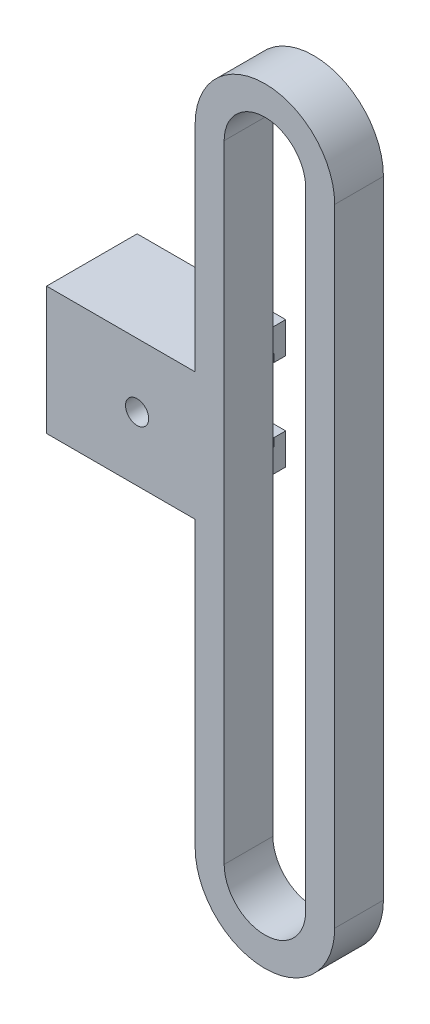
ISO-10303-21;
HEADER;
FILE_DESCRIPTION(('STEP AP214'),'2;1');
FILE_NAME('part.step','',(''),(''),'','','');
FILE_SCHEMA(('AUTOMOTIVE_DESIGN { 1 0 10303 214 1 1 1 1 }'));
ENDSEC;
DATA;
#1=APPLICATION_CONTEXT('core data for automotive mechanical design processes');
#2=APPLICATION_PROTOCOL_DEFINITION('international standard','automotive_design',2000,#1);
#3=PRODUCT_CONTEXT('',#1,'mechanical');
#4=PRODUCT('Part','Part','',(#3));
#5=PRODUCT_RELATED_PRODUCT_CATEGORY('part','',(#4));
#6=PRODUCT_DEFINITION_FORMATION('','',#4);
#7=PRODUCT_DEFINITION_CONTEXT('part definition',#1,'design');
#8=PRODUCT_DEFINITION('design','',#6,#7);
#9=PRODUCT_DEFINITION_SHAPE('','',#8);
#10=(LENGTH_UNIT() NAMED_UNIT(*) SI_UNIT(.MILLI.,.METRE.));
#11=(NAMED_UNIT(*) PLANE_ANGLE_UNIT() SI_UNIT($,.RADIAN.));
#12=(NAMED_UNIT(*) SI_UNIT($,.STERADIAN.) SOLID_ANGLE_UNIT());
#13=UNCERTAINTY_MEASURE_WITH_UNIT(LENGTH_MEASURE(1.E-05),#10,'distance_accuracy_value','');
#14=(GEOMETRIC_REPRESENTATION_CONTEXT(3) GLOBAL_UNCERTAINTY_ASSIGNED_CONTEXT((#13)) GLOBAL_UNIT_ASSIGNED_CONTEXT((#10,
#11,#12)) REPRESENTATION_CONTEXT('',''));
#15=CARTESIAN_POINT('',(0.,0.,0.));
#16=DIRECTION('',(0.,0.,1.));
#17=DIRECTION('',(1.,0.,0.));
#18=AXIS2_PLACEMENT_3D('',#15,#16,#17);
#19=CARTESIAN_POINT('',(-6.01,10.3450930626058,4.2));
#20=DIRECTION('',(1.,0.,0.));
#21=DIRECTION('',(0.,1.,0.));
#22=AXIS2_PLACEMENT_3D('',#19,#20,#21);
#23=PLANE('',#22);
#24=DIRECTION('',(0.,0.,-1.));
#25=VECTOR('',#24,1.);
#26=CARTESIAN_POINT('',(-6.01,-8.15490693739424,4.2));
#27=LINE('',#26,#25);
#28=CARTESIAN_POINT('',(-6.01,-8.15490693739424,4.2));
#29=VERTEX_POINT('',#28);
#30=CARTESIAN_POINT('',(-6.01,-8.15490693739424,0.));
#31=VERTEX_POINT('',#30);
#32=EDGE_CURVE('E263',#29,#31,#27,.T.);
#33=ORIENTED_EDGE('',*,*,#32,.F.);
#34=DIRECTION('',(0.,-1.,0.));
#35=VECTOR('',#34,1.);
#36=CARTESIAN_POINT('',(-6.01,10.3450930626058,4.2));
#37=LINE('',#36,#35);
#38=CARTESIAN_POINT('',(-6.01,10.3450930626058,4.2));
#39=VERTEX_POINT('',#38);
#40=EDGE_CURVE('E325',#39,#29,#37,.T.);
#41=ORIENTED_EDGE('',*,*,#40,.F.);
#42=DIRECTION('',(0.,0.,-1.));
#43=VECTOR('',#42,1.);
#44=CARTESIAN_POINT('',(-6.01,10.3450930626058,4.2));
#45=LINE('',#44,#43);
#46=CARTESIAN_POINT('',(-6.01,10.3450930626058,0.));
#47=VERTEX_POINT('',#46);
#48=EDGE_CURVE('E351',#39,#47,#45,.T.);
#49=ORIENTED_EDGE('',*,*,#48,.T.);
#50=DIRECTION('',(0.,-1.,0.));
#51=VECTOR('',#50,1.);
#52=CARTESIAN_POINT('',(-6.01,10.3450930626058,0.));
#53=LINE('',#52,#51);
#54=EDGE_CURVE('E336',#47,#31,#53,.T.);
#55=ORIENTED_EDGE('',*,*,#54,.T.);
#56=EDGE_LOOP('',(#33,#41,#49,#55));
#57=FACE_BOUND('',#56,.T.);
#58=ADVANCED_FACE('F32',(#57),#23,.F.);
#59=DIRECTION('',(0.,0.,1.));
#60=VECTOR('',#59,1.);
#61=CARTESIAN_POINT('',(-6.01,-10.1549069373942,4.2));
#62=LINE('',#61,#60);
#63=CARTESIAN_POINT('',(-6.01,-10.1549069373942,0.));
#64=VERTEX_POINT('',#63);
#65=CARTESIAN_POINT('',(-6.01,-10.1549069373942,2.2));
#66=VERTEX_POINT('',#65);
#67=EDGE_CURVE('E11',#64,#66,#62,.T.);
#68=ORIENTED_EDGE('',*,*,#67,.F.);
#69=CARTESIAN_POINT('',(-6.01,-17.1549069373942,0.));
#70=VERTEX_POINT('',#69);
#71=EDGE_CURVE('E458',#64,#70,#53,.T.);
#72=ORIENTED_EDGE('',*,*,#71,.T.);
#73=DIRECTION('',(0.,0.,-1.));
#74=VECTOR('',#73,1.);
#75=CARTESIAN_POINT('',(-6.01,-17.1549069373942,2.2));
#76=LINE('',#75,#74);
#77=CARTESIAN_POINT('',(-6.01,-17.1549069373942,2.2));
#78=VERTEX_POINT('',#77);
#79=EDGE_CURVE('E51',#78,#70,#76,.T.);
#80=ORIENTED_EDGE('',*,*,#79,.F.);
#81=DIRECTION('',(0.,-1.,0.));
#82=VECTOR('',#81,1.);
#83=CARTESIAN_POINT('',(-6.01,-10.1549069373942,2.2));
#84=LINE('',#83,#82);
#85=EDGE_CURVE('E47',#66,#78,#84,.T.);
#86=ORIENTED_EDGE('',*,*,#85,.F.);
#87=EDGE_LOOP('',(#68,#72,#80,#86));
#88=FACE_BOUND('',#87,.T.);
#89=ADVANCED_FACE('F410',(#88),#23,.F.);
#90=DIRECTION('',(0.,0.,1.));
#91=VECTOR('',#90,1.);
#92=CARTESIAN_POINT('',(-6.01,-19.1549069373942,4.2));
#93=LINE('',#92,#91);
#94=CARTESIAN_POINT('',(-6.01,-19.1549069373942,0.));
#95=VERTEX_POINT('',#94);
#96=CARTESIAN_POINT('',(-6.01,-19.1549069373942,4.2));
#97=VERTEX_POINT('',#96);
#98=EDGE_CURVE('E40',#95,#97,#93,.T.);
#99=ORIENTED_EDGE('',*,*,#98,.F.);
#100=CARTESIAN_POINT('',(-6.01,-43.6549069373942,0.));
#101=VERTEX_POINT('',#100);
#102=EDGE_CURVE('E335',#95,#101,#53,.T.);
#103=ORIENTED_EDGE('',*,*,#102,.T.);
#104=DIRECTION('',(0.,0.,-1.));
#105=VECTOR('',#104,1.);
#106=CARTESIAN_POINT('',(-6.01,-43.6549069373942,4.2));
#107=LINE('',#106,#105);
#108=CARTESIAN_POINT('',(-6.01,-43.6549069373942,4.2));
#109=VERTEX_POINT('',#108);
#110=EDGE_CURVE('E348',#109,#101,#107,.T.);
#111=ORIENTED_EDGE('',*,*,#110,.F.);
#112=EDGE_CURVE('E323',#97,#109,#37,.T.);
#113=ORIENTED_EDGE('',*,*,#112,.F.);
#114=EDGE_LOOP('',(#99,#103,#111,#113));
#115=FACE_BOUND('',#114,.T.);
#116=ADVANCED_FACE('F412',(#115),#23,.F.);
#117=CARTESIAN_POINT('',(0.,10.3450930626058,4.2));
#118=DIRECTION('',(0.,0.,1.));
#119=DIRECTION('',(1.,0.,0.));
#120=AXIS2_PLACEMENT_3D('',#117,#118,#119);
#121=PLANE('',#120);
#122=CARTESIAN_POINT('',(-11.01,-13.6549069373942,4.2));
#123=DIRECTION('',(0.,0.,1.));
#124=DIRECTION('',(1.,0.,0.));
#125=AXIS2_PLACEMENT_3D('',#122,#123,#124);
#126=CIRCLE('',#125,1.);
#127=CARTESIAN_POINT('',(-10.01,-13.6549069373942,4.2));
#128=VERTEX_POINT('',#127);
#129=EDGE_CURVE('E248',#128,#128,#126,.T.);
#130=ORIENTED_EDGE('',*,*,#129,.F.);
#131=EDGE_LOOP('',(#130));
#132=FACE_BOUND('',#131,.T.);
#133=CARTESIAN_POINT('',(0.,10.3450930626058,4.2));
#134=DIRECTION('',(0.,0.,1.));
#135=DIRECTION('',(1.,0.,0.));
#136=AXIS2_PLACEMENT_3D('',#133,#134,#135);
#137=CIRCLE('',#136,6.01);
#138=CARTESIAN_POINT('',(6.01,10.3450930626058,4.2));
#139=VERTEX_POINT('',#138);
#140=EDGE_CURVE('E320',#139,#39,#137,.T.);
#141=ORIENTED_EDGE('',*,*,#140,.T.);
#142=ORIENTED_EDGE('',*,*,#40,.T.);
#143=DIRECTION('',(1.,0.,0.));
#144=VECTOR('',#143,1.);
#145=CARTESIAN_POINT('',(-18.81,-8.15490693739424,4.2));
#146=LINE('',#145,#144);
#147=CARTESIAN_POINT('',(-18.81,-8.15490693739424,4.2));
#148=VERTEX_POINT('',#147);
#149=EDGE_CURVE('E285',#148,#29,#146,.T.);
#150=ORIENTED_EDGE('',*,*,#149,.F.);
#151=DIRECTION('',(0.,1.,0.));
#152=VECTOR('',#151,1.);
#153=CARTESIAN_POINT('',(-18.81,-19.1549069373942,4.2));
#154=LINE('',#153,#152);
#155=CARTESIAN_POINT('',(-18.81,-19.1549069373942,4.2));
#156=VERTEX_POINT('',#155);
#157=EDGE_CURVE('E252',#156,#148,#154,.T.);
#158=ORIENTED_EDGE('',*,*,#157,.F.);
#159=DIRECTION('',(1.,0.,0.));
#160=VECTOR('',#159,1.);
#161=CARTESIAN_POINT('',(-18.81,-19.1549069373942,4.2));
#162=LINE('',#161,#160);
#163=EDGE_CURVE('E187',#156,#97,#162,.T.);
#164=ORIENTED_EDGE('',*,*,#163,.T.);
#165=ORIENTED_EDGE('',*,*,#112,.T.);
#166=CARTESIAN_POINT('',(0.,-43.6549069373942,4.2));
#167=DIRECTION('',(0.,0.,1.));
#168=DIRECTION('',(1.,0.,0.));
#169=AXIS2_PLACEMENT_3D('',#166,#167,#168);
#170=CIRCLE('',#169,6.01);
#171=CARTESIAN_POINT('',(6.01000000000001,-43.6549069373942,4.2));
#172=VERTEX_POINT('',#171);
#173=EDGE_CURVE('E328',#109,#172,#170,.T.);
#174=ORIENTED_EDGE('',*,*,#173,.T.);
#175=DIRECTION('',(0.,1.,0.));
#176=VECTOR('',#175,1.);
#177=CARTESIAN_POINT('',(6.01,10.3450930626058,4.2));
#178=LINE('',#177,#176);
#179=EDGE_CURVE('E330',#172,#139,#178,.T.);
#180=ORIENTED_EDGE('',*,*,#179,.T.);
#181=EDGE_LOOP('',(#141,#142,#150,#158,#164,#165,#174,#180));
#182=FACE_BOUND('',#181,.T.);
#183=DIRECTION('',(0.,-1.,0.));
#184=VECTOR('',#183,1.);
#185=CARTESIAN_POINT('',(-3.51,10.3450930626058,4.2));
#186=LINE('',#185,#184);
#187=CARTESIAN_POINT('',(-3.51,10.3450930626058,4.2));
#188=VERTEX_POINT('',#187);
#189=CARTESIAN_POINT('',(-3.51,-43.6549069373942,4.2));
#190=VERTEX_POINT('',#189);
#191=EDGE_CURVE('E291',#188,#190,#186,.T.);
#192=ORIENTED_EDGE('',*,*,#191,.F.);
#193=CARTESIAN_POINT('',(0.,10.3450930626058,4.2));
#194=DIRECTION('',(0.,0.,1.));
#195=DIRECTION('',(1.,0.,0.));
#196=AXIS2_PLACEMENT_3D('',#193,#194,#195);
#197=CIRCLE('',#196,3.51);
#198=CARTESIAN_POINT('',(3.51,10.3450930626058,4.2));
#199=VERTEX_POINT('',#198);
#200=EDGE_CURVE('E289',#199,#188,#197,.T.);
#201=ORIENTED_EDGE('',*,*,#200,.F.);
#202=DIRECTION('',(0.,1.,0.));
#203=VECTOR('',#202,1.);
#204=CARTESIAN_POINT('',(3.51,10.3450930626058,4.2));
#205=LINE('',#204,#203);
#206=CARTESIAN_POINT('',(3.51000000000001,-43.6549069373942,4.2));
#207=VERTEX_POINT('',#206);
#208=EDGE_CURVE('E297',#207,#199,#205,.T.);
#209=ORIENTED_EDGE('',*,*,#208,.F.);
#210=CARTESIAN_POINT('',(0.,-43.6549069373942,4.2));
#211=DIRECTION('',(0.,0.,1.));
#212=DIRECTION('',(1.,0.,0.));
#213=AXIS2_PLACEMENT_3D('',#210,#211,#212);
#214=CIRCLE('',#213,3.51);
#215=EDGE_CURVE('E294',#190,#207,#214,.T.);
#216=ORIENTED_EDGE('',*,*,#215,.F.);
#217=EDGE_LOOP('',(#192,#201,#209,#216));
#218=FACE_BOUND('',#217,.T.);
#219=ADVANCED_FACE('F356',(#132,#182,#218),#121,.T.);
#220=CARTESIAN_POINT('',(0.,10.3450930626058,0.));
#221=DIRECTION('',(0.,0.,1.));
#222=DIRECTION('',(1.,0.,0.));
#223=AXIS2_PLACEMENT_3D('',#220,#221,#222);
#224=PLANE('',#223);
#225=CARTESIAN_POINT('',(0.,10.3450930626058,0.));
#226=DIRECTION('',(0.,0.,1.));
#227=DIRECTION('',(1.,0.,0.));
#228=AXIS2_PLACEMENT_3D('',#225,#226,#227);
#229=CIRCLE('',#228,6.01);
#230=CARTESIAN_POINT('',(6.01,10.3450930626058,0.));
#231=VERTEX_POINT('',#230);
#232=EDGE_CURVE('E319',#231,#47,#229,.T.);
#233=ORIENTED_EDGE('',*,*,#232,.F.);
#234=DIRECTION('',(0.,1.,0.));
#235=VECTOR('',#234,1.);
#236=CARTESIAN_POINT('',(6.01,10.3450930626058,0.));
#237=LINE('',#236,#235);
#238=CARTESIAN_POINT('',(6.01000000000001,-43.6549069373942,0.));
#239=VERTEX_POINT('',#238);
#240=EDGE_CURVE('E324',#239,#231,#237,.T.);
#241=ORIENTED_EDGE('',*,*,#240,.F.);
#242=CARTESIAN_POINT('',(0.,-43.6549069373942,0.));
#243=DIRECTION('',(0.,0.,1.));
#244=DIRECTION('',(1.,0.,0.));
#245=AXIS2_PLACEMENT_3D('',#242,#243,#244);
#246=CIRCLE('',#245,6.01);
#247=EDGE_CURVE('E339',#101,#239,#246,.T.);
#248=ORIENTED_EDGE('',*,*,#247,.F.);
#249=ORIENTED_EDGE('',*,*,#102,.F.);
#250=EDGE_CURVE('E459',#70,#95,#53,.T.);
#251=ORIENTED_EDGE('',*,*,#250,.F.);
#252=ORIENTED_EDGE('',*,*,#71,.F.);
#253=EDGE_CURVE('E340',#31,#64,#53,.T.);
#254=ORIENTED_EDGE('',*,*,#253,.F.);
#255=ORIENTED_EDGE('',*,*,#54,.F.);
#256=EDGE_LOOP('',(#233,#241,#248,#249,#251,#252,#254,#255));
#257=FACE_BOUND('',#256,.T.);
#258=CARTESIAN_POINT('',(0.,10.3450930626058,0.));
#259=DIRECTION('',(0.,0.,1.));
#260=DIRECTION('',(1.,0.,0.));
#261=AXIS2_PLACEMENT_3D('',#258,#259,#260);
#262=CIRCLE('',#261,3.51);
#263=CARTESIAN_POINT('',(3.51,10.3450930626058,0.));
#264=VERTEX_POINT('',#263);
#265=CARTESIAN_POINT('',(-3.51,10.3450930626058,0.));
#266=VERTEX_POINT('',#265);
#267=EDGE_CURVE('E288',#264,#266,#262,.T.);
#268=ORIENTED_EDGE('',*,*,#267,.T.);
#269=DIRECTION('',(0.,-1.,0.));
#270=VECTOR('',#269,1.);
#271=CARTESIAN_POINT('',(-3.51,10.3450930626058,0.));
#272=LINE('',#271,#270);
#273=CARTESIAN_POINT('',(-3.51,-43.6549069373942,0.));
#274=VERTEX_POINT('',#273);
#275=EDGE_CURVE('E302',#266,#274,#272,.T.);
#276=ORIENTED_EDGE('',*,*,#275,.T.);
#277=CARTESIAN_POINT('',(0.,-43.6549069373942,0.));
#278=DIRECTION('',(0.,0.,1.));
#279=DIRECTION('',(1.,0.,0.));
#280=AXIS2_PLACEMENT_3D('',#277,#278,#279);
#281=CIRCLE('',#280,3.51);
#282=CARTESIAN_POINT('',(3.51000000000001,-43.6549069373942,0.));
#283=VERTEX_POINT('',#282);
#284=EDGE_CURVE('E305',#274,#283,#281,.T.);
#285=ORIENTED_EDGE('',*,*,#284,.T.);
#286=DIRECTION('',(0.,1.,0.));
#287=VECTOR('',#286,1.);
#288=CARTESIAN_POINT('',(3.51,10.3450930626058,0.));
#289=LINE('',#288,#287);
#290=EDGE_CURVE('E292',#283,#264,#289,.T.);
#291=ORIENTED_EDGE('',*,*,#290,.T.);
#292=EDGE_LOOP('',(#268,#276,#285,#291));
#293=FACE_BOUND('',#292,.T.);
#294=ADVANCED_FACE('F421',(#257,#293),#224,.F.);
#295=CARTESIAN_POINT('',(0.,10.3450930626058,4.2));
#296=DIRECTION('',(0.,0.,-1.));
#297=DIRECTION('',(-1.,0.,0.));
#298=AXIS2_PLACEMENT_3D('',#295,#296,#297);
#299=CYLINDRICAL_SURFACE('',#298,6.01);
#300=ORIENTED_EDGE('',*,*,#232,.T.);
#301=ORIENTED_EDGE('',*,*,#48,.F.);
#302=ORIENTED_EDGE('',*,*,#140,.F.);
#303=DIRECTION('',(0.,0.,-1.));
#304=VECTOR('',#303,1.);
#305=CARTESIAN_POINT('',(6.01,10.3450930626058,4.2));
#306=LINE('',#305,#304);
#307=EDGE_CURVE('E332',#139,#231,#306,.T.);
#308=ORIENTED_EDGE('',*,*,#307,.T.);
#309=EDGE_LOOP('',(#300,#301,#302,#308));
#310=FACE_BOUND('',#309,.T.);
#311=ADVANCED_FACE('F34',(#310),#299,.T.);
#312=CARTESIAN_POINT('',(0.,-43.6549069373942,4.2));
#313=DIRECTION('',(0.,0.,-1.));
#314=DIRECTION('',(-1.,0.,0.));
#315=AXIS2_PLACEMENT_3D('',#312,#313,#314);
#316=CYLINDRICAL_SURFACE('',#315,6.01);
#317=ORIENTED_EDGE('',*,*,#247,.T.);
#318=DIRECTION('',(0.,0.,-1.));
#319=VECTOR('',#318,1.);
#320=CARTESIAN_POINT('',(6.01000000000001,-43.6549069373942,4.2));
#321=LINE('',#320,#319);
#322=EDGE_CURVE('E345',#172,#239,#321,.T.);
#323=ORIENTED_EDGE('',*,*,#322,.F.);
#324=ORIENTED_EDGE('',*,*,#173,.F.);
#325=ORIENTED_EDGE('',*,*,#110,.T.);
#326=EDGE_LOOP('',(#317,#323,#324,#325));
#327=FACE_BOUND('',#326,.T.);
#328=ADVANCED_FACE('F436',(#327),#316,.T.);
#329=CARTESIAN_POINT('',(6.01,10.3450930626058,4.2));
#330=DIRECTION('',(-1.,0.,0.));
#331=DIRECTION('',(0.,-1.,0.));
#332=AXIS2_PLACEMENT_3D('',#329,#330,#331);
#333=PLANE('',#332);
#334=ORIENTED_EDGE('',*,*,#240,.T.);
#335=ORIENTED_EDGE('',*,*,#307,.F.);
#336=ORIENTED_EDGE('',*,*,#179,.F.);
#337=ORIENTED_EDGE('',*,*,#322,.T.);
#338=EDGE_LOOP('',(#334,#335,#336,#337));
#339=FACE_BOUND('',#338,.T.);
#340=ADVANCED_FACE('F434',(#339),#333,.F.);
#341=CARTESIAN_POINT('',(0.,10.3450930626058,4.2));
#342=DIRECTION('',(0.,0.,-1.));
#343=DIRECTION('',(-1.,0.,0.));
#344=AXIS2_PLACEMENT_3D('',#341,#342,#343);
#345=CYLINDRICAL_SURFACE('',#344,3.51);
#346=ORIENTED_EDGE('',*,*,#267,.F.);
#347=DIRECTION('',(0.,0.,-1.));
#348=VECTOR('',#347,1.);
#349=CARTESIAN_POINT('',(3.51,10.3450930626058,4.2));
#350=LINE('',#349,#348);
#351=EDGE_CURVE('E299',#199,#264,#350,.T.);
#352=ORIENTED_EDGE('',*,*,#351,.F.);
#353=ORIENTED_EDGE('',*,*,#200,.T.);
#354=DIRECTION('',(0.,0.,-1.));
#355=VECTOR('',#354,1.);
#356=CARTESIAN_POINT('',(-3.51,10.3450930626058,4.2));
#357=LINE('',#356,#355);
#358=EDGE_CURVE('E316',#188,#266,#357,.T.);
#359=ORIENTED_EDGE('',*,*,#358,.T.);
#360=EDGE_LOOP('',(#346,#352,#353,#359));
#361=FACE_BOUND('',#360,.T.);
#362=ADVANCED_FACE('F431',(#361),#345,.F.);
#363=CARTESIAN_POINT('',(-3.51,10.3450930626058,4.2));
#364=DIRECTION('',(1.,0.,0.));
#365=DIRECTION('',(0.,1.,0.));
#366=AXIS2_PLACEMENT_3D('',#363,#364,#365);
#367=PLANE('',#366);
#368=ORIENTED_EDGE('',*,*,#275,.F.);
#369=ORIENTED_EDGE('',*,*,#358,.F.);
#370=ORIENTED_EDGE('',*,*,#191,.T.);
#371=DIRECTION('',(0.,0.,-1.));
#372=VECTOR('',#371,1.);
#373=CARTESIAN_POINT('',(-3.51,-43.6549069373942,4.2));
#374=LINE('',#373,#372);
#375=EDGE_CURVE('E314',#190,#274,#374,.T.);
#376=ORIENTED_EDGE('',*,*,#375,.T.);
#377=EDGE_LOOP('',(#368,#369,#370,#376));
#378=FACE_BOUND('',#377,.T.);
#379=ADVANCED_FACE('F485',(#378),#367,.T.);
#380=CARTESIAN_POINT('',(0.,-43.6549069373942,4.2));
#381=DIRECTION('',(0.,0.,-1.));
#382=DIRECTION('',(-1.,0.,0.));
#383=AXIS2_PLACEMENT_3D('',#380,#381,#382);
#384=CYLINDRICAL_SURFACE('',#383,3.51);
#385=ORIENTED_EDGE('',*,*,#284,.F.);
#386=ORIENTED_EDGE('',*,*,#375,.F.);
#387=ORIENTED_EDGE('',*,*,#215,.T.);
#388=DIRECTION('',(0.,0.,-1.));
#389=VECTOR('',#388,1.);
#390=CARTESIAN_POINT('',(3.51000000000001,-43.6549069373942,4.2));
#391=LINE('',#390,#389);
#392=EDGE_CURVE('E312',#207,#283,#391,.T.);
#393=ORIENTED_EDGE('',*,*,#392,.T.);
#394=EDGE_LOOP('',(#385,#386,#387,#393));
#395=FACE_BOUND('',#394,.T.);
#396=ADVANCED_FACE('F467',(#395),#384,.F.);
#397=CARTESIAN_POINT('',(3.51,10.3450930626058,4.2));
#398=DIRECTION('',(-1.,0.,0.));
#399=DIRECTION('',(0.,-1.,0.));
#400=AXIS2_PLACEMENT_3D('',#397,#398,#399);
#401=PLANE('',#400);
#402=ORIENTED_EDGE('',*,*,#290,.F.);
#403=ORIENTED_EDGE('',*,*,#392,.F.);
#404=ORIENTED_EDGE('',*,*,#208,.T.);
#405=ORIENTED_EDGE('',*,*,#351,.T.);
#406=EDGE_LOOP('',(#402,#403,#404,#405));
#407=FACE_BOUND('',#406,.T.);
#408=ADVANCED_FACE('F461',(#407),#401,.T.);
#409=CARTESIAN_POINT('',(-6.01,-8.15490693739424,4.2));
#410=DIRECTION('',(-1.,0.,0.));
#411=DIRECTION('',(0.,-1.,0.));
#412=AXIS2_PLACEMENT_3D('',#409,#410,#411);
#413=PLANE('',#412);
#414=CARTESIAN_POINT('',(-6.01,-8.15490693739424,-3.6));
#415=VERTEX_POINT('',#414);
#416=EDGE_CURVE('E251',#31,#415,#27,.T.);
#417=ORIENTED_EDGE('',*,*,#416,.F.);
#418=ORIENTED_EDGE('',*,*,#253,.T.);
#419=DIRECTION('',(0.,0.,1.));
#420=VECTOR('',#419,1.);
#421=CARTESIAN_POINT('',(-6.01,-10.1549069373942,-2.6));
#422=LINE('',#421,#420);
#423=CARTESIAN_POINT('',(-6.01,-10.1549069373942,-2.6));
#424=VERTEX_POINT('',#423);
#425=EDGE_CURVE('E266',#424,#64,#422,.T.);
#426=ORIENTED_EDGE('',*,*,#425,.F.);
#427=DIRECTION('',(0.,-1.,0.));
#428=VECTOR('',#427,1.);
#429=CARTESIAN_POINT('',(-6.01,-8.15490693739424,-2.6));
#430=LINE('',#429,#428);
#431=CARTESIAN_POINT('',(-6.01,-10.8549069373942,-2.6));
#432=VERTEX_POINT('',#431);
#433=EDGE_CURVE('E220',#424,#432,#430,.T.);
#434=ORIENTED_EDGE('',*,*,#433,.T.);
#435=DIRECTION('',(0.,0.,-1.));
#436=VECTOR('',#435,1.);
#437=CARTESIAN_POINT('',(-6.01,-10.8549069373942,-2.6));
#438=LINE('',#437,#436);
#439=CARTESIAN_POINT('',(-6.01,-10.8549069373942,-3.6));
#440=VERTEX_POINT('',#439);
#441=EDGE_CURVE('E233',#432,#440,#438,.T.);
#442=ORIENTED_EDGE('',*,*,#441,.T.);
#443=DIRECTION('',(0.,1.,0.));
#444=VECTOR('',#443,1.);
#445=CARTESIAN_POINT('',(-6.01,-8.15490693739424,-3.6));
#446=LINE('',#445,#444);
#447=EDGE_CURVE('E225',#440,#415,#446,.T.);
#448=ORIENTED_EDGE('',*,*,#447,.T.);
#449=EDGE_LOOP('',(#417,#418,#426,#434,#442,#448));
#450=FACE_BOUND('',#449,.T.);
#451=ADVANCED_FACE('F456',(#450),#413,.F.);
#452=CARTESIAN_POINT('',(-6.00999999999999,-17.1549069373942,-2.6));
#453=VERTEX_POINT('',#452);
#454=EDGE_CURVE('E270',#70,#453,#76,.T.);
#455=ORIENTED_EDGE('',*,*,#454,.F.);
#456=ORIENTED_EDGE('',*,*,#250,.T.);
#457=DIRECTION('',(0.,0.,1.));
#458=VECTOR('',#457,1.);
#459=CARTESIAN_POINT('',(-6.01,-19.1549069373942,-2.6));
#460=LINE('',#459,#458);
#461=CARTESIAN_POINT('',(-6.00999999999999,-19.1549069373942,-3.6));
#462=VERTEX_POINT('',#461);
#463=EDGE_CURVE('E255',#462,#95,#460,.T.);
#464=ORIENTED_EDGE('',*,*,#463,.F.);
#465=DIRECTION('',(0.,1.,0.));
#466=VECTOR('',#465,1.);
#467=CARTESIAN_POINT('',(-6.00999999999999,-19.1549069373942,-3.6));
#468=LINE('',#467,#466);
#469=CARTESIAN_POINT('',(-6.00999999999999,-16.4549069373942,-3.6));
#470=VERTEX_POINT('',#469);
#471=EDGE_CURVE('E199',#462,#470,#468,.T.);
#472=ORIENTED_EDGE('',*,*,#471,.T.);
#473=DIRECTION('',(0.,0.,1.));
#474=VECTOR('',#473,1.);
#475=CARTESIAN_POINT('',(-6.00999999999999,-16.4549069373942,-2.6));
#476=LINE('',#475,#474);
#477=CARTESIAN_POINT('',(-6.00999999999999,-16.4549069373942,-2.6));
#478=VERTEX_POINT('',#477);
#479=EDGE_CURVE('E209',#470,#478,#476,.T.);
#480=ORIENTED_EDGE('',*,*,#479,.T.);
#481=DIRECTION('',(0.,-1.,0.));
#482=VECTOR('',#481,1.);
#483=CARTESIAN_POINT('',(-6.00999999999999,-19.1549069373942,-2.6));
#484=LINE('',#483,#482);
#485=EDGE_CURVE('E212',#478,#453,#484,.T.);
#486=ORIENTED_EDGE('',*,*,#485,.T.);
#487=EDGE_LOOP('',(#455,#456,#464,#472,#480,#486));
#488=FACE_BOUND('',#487,.T.);
#489=ADVANCED_FACE('F396',(#488),#413,.F.);
#490=CARTESIAN_POINT('',(-18.81,-8.15490693739424,4.2));
#491=DIRECTION('',(0.,-1.,0.));
#492=DIRECTION('',(1.,0.,0.));
#493=AXIS2_PLACEMENT_3D('',#490,#491,#492);
#494=PLANE('',#493);
#495=ORIENTED_EDGE('',*,*,#32,.T.);
#496=ORIENTED_EDGE('',*,*,#416,.T.);
#497=DIRECTION('',(1.,0.,0.));
#498=VECTOR('',#497,1.);
#499=CARTESIAN_POINT('',(-18.81,-8.15490693739424,-3.6));
#500=LINE('',#499,#498);
#501=CARTESIAN_POINT('',(-18.81,-8.15490693739424,-3.6));
#502=VERTEX_POINT('',#501);
#503=EDGE_CURVE('E238',#502,#415,#500,.T.);
#504=ORIENTED_EDGE('',*,*,#503,.F.);
#505=DIRECTION('',(0.,0.,-1.));
#506=VECTOR('',#505,1.);
#507=CARTESIAN_POINT('',(-18.81,-8.15490693739424,4.2));
#508=LINE('',#507,#506);
#509=EDGE_CURVE('E254',#148,#502,#508,.T.);
#510=ORIENTED_EDGE('',*,*,#509,.F.);
#511=ORIENTED_EDGE('',*,*,#149,.T.);
#512=EDGE_LOOP('',(#495,#496,#504,#510,#511));
#513=FACE_BOUND('',#512,.T.);
#514=ADVANCED_FACE('F365',(#513),#494,.F.);
#515=CARTESIAN_POINT('',(-18.81,-10.1549069373942,-2.6));
#516=DIRECTION('',(0.,1.,0.));
#517=DIRECTION('',(-1.,0.,0.));
#518=AXIS2_PLACEMENT_3D('',#515,#516,#517);
#519=PLANE('',#518);
#520=ORIENTED_EDGE('',*,*,#425,.T.);
#521=ORIENTED_EDGE('',*,*,#67,.T.);
#522=DIRECTION('',(1.,0.,0.));
#523=VECTOR('',#522,1.);
#524=CARTESIAN_POINT('',(-18.81,-10.1549069373942,2.2));
#525=LINE('',#524,#523);
#526=CARTESIAN_POINT('',(-18.81,-10.1549069373942,2.2));
#527=VERTEX_POINT('',#526);
#528=EDGE_CURVE('E279',#527,#66,#525,.T.);
#529=ORIENTED_EDGE('',*,*,#528,.F.);
#530=DIRECTION('',(0.,0.,1.));
#531=VECTOR('',#530,1.);
#532=CARTESIAN_POINT('',(-18.81,-10.1549069373942,-2.6));
#533=LINE('',#532,#531);
#534=CARTESIAN_POINT('',(-18.81,-10.1549069373942,-2.6));
#535=VERTEX_POINT('',#534);
#536=EDGE_CURVE('E257',#535,#527,#533,.T.);
#537=ORIENTED_EDGE('',*,*,#536,.F.);
#538=DIRECTION('',(1.,0.,0.));
#539=VECTOR('',#538,1.);
#540=CARTESIAN_POINT('',(-18.81,-10.1549069373942,-2.6));
#541=LINE('',#540,#539);
#542=EDGE_CURVE('E282',#535,#424,#541,.T.);
#543=ORIENTED_EDGE('',*,*,#542,.T.);
#544=EDGE_LOOP('',(#520,#521,#529,#537,#543));
#545=FACE_BOUND('',#544,.T.);
#546=ADVANCED_FACE('F381',(#545),#519,.F.);
#547=CARTESIAN_POINT('',(-18.81,-10.1549069373942,2.2));
#548=DIRECTION('',(0.,0.,1.));
#549=DIRECTION('',(0.,-1.,0.));
#550=AXIS2_PLACEMENT_3D('',#547,#548,#549);
#551=PLANE('',#550);
#552=CARTESIAN_POINT('',(-11.01,-13.6549069373942,2.2));
#553=DIRECTION('',(0.,0.,-1.));
#554=DIRECTION('',(0.,1.,0.));
#555=AXIS2_PLACEMENT_3D('',#552,#553,#554);
#556=CIRCLE('',#555,1.);
#557=CARTESIAN_POINT('',(-11.01,-12.6549069373942,2.2));
#558=VERTEX_POINT('',#557);
#559=EDGE_CURVE('E241',#558,#558,#556,.T.);
#560=ORIENTED_EDGE('',*,*,#559,.F.);
#561=EDGE_LOOP('',(#560));
#562=FACE_BOUND('',#561,.T.);
#563=ORIENTED_EDGE('',*,*,#85,.T.);
#564=DIRECTION('',(1.,0.,0.));
#565=VECTOR('',#564,1.);
#566=CARTESIAN_POINT('',(-18.81,-17.1549069373942,2.2));
#567=LINE('',#566,#565);
#568=CARTESIAN_POINT('',(-18.81,-17.1549069373942,2.2));
#569=VERTEX_POINT('',#568);
#570=EDGE_CURVE('E276',#569,#78,#567,.T.);
#571=ORIENTED_EDGE('',*,*,#570,.F.);
#572=DIRECTION('',(0.,-1.,0.));
#573=VECTOR('',#572,1.);
#574=CARTESIAN_POINT('',(-18.81,-10.1549069373942,2.2));
#575=LINE('',#574,#573);
#576=EDGE_CURVE('E259',#527,#569,#575,.T.);
#577=ORIENTED_EDGE('',*,*,#576,.F.);
#578=ORIENTED_EDGE('',*,*,#528,.T.);
#579=EDGE_LOOP('',(#563,#571,#577,#578));
#580=FACE_BOUND('',#579,.T.);
#581=ADVANCED_FACE('F385',(#562,#580),#551,.F.);
#582=CARTESIAN_POINT('',(-18.81,-17.1549069373942,2.2));
#583=DIRECTION('',(0.,-1.,0.));
#584=DIRECTION('',(1.,0.,0.));
#585=AXIS2_PLACEMENT_3D('',#582,#583,#584);
#586=PLANE('',#585);
#587=ORIENTED_EDGE('',*,*,#79,.T.);
#588=ORIENTED_EDGE('',*,*,#454,.T.);
#589=DIRECTION('',(1.,0.,0.));
#590=VECTOR('',#589,1.);
#591=CARTESIAN_POINT('',(-18.81,-17.1549069373942,-2.6));
#592=LINE('',#591,#590);
#593=CARTESIAN_POINT('',(-18.81,-17.1549069373942,-2.6));
#594=VERTEX_POINT('',#593);
#595=EDGE_CURVE('E274',#594,#453,#592,.T.);
#596=ORIENTED_EDGE('',*,*,#595,.F.);
#597=DIRECTION('',(0.,0.,-1.));
#598=VECTOR('',#597,1.);
#599=CARTESIAN_POINT('',(-18.81,-17.1549069373942,2.2));
#600=LINE('',#599,#598);
#601=EDGE_CURVE('E191',#569,#594,#600,.T.);
#602=ORIENTED_EDGE('',*,*,#601,.F.);
#603=ORIENTED_EDGE('',*,*,#570,.T.);
#604=EDGE_LOOP('',(#587,#588,#596,#602,#603));
#605=FACE_BOUND('',#604,.T.);
#606=ADVANCED_FACE('F390',(#605),#586,.F.);
#607=CARTESIAN_POINT('',(-18.81,-19.1549069373942,-2.6));
#608=DIRECTION('',(0.,1.,0.));
#609=DIRECTION('',(-1.,0.,0.));
#610=AXIS2_PLACEMENT_3D('',#607,#608,#609);
#611=PLANE('',#610);
#612=ORIENTED_EDGE('',*,*,#463,.T.);
#613=ORIENTED_EDGE('',*,*,#98,.T.);
#614=ORIENTED_EDGE('',*,*,#163,.F.);
#615=DIRECTION('',(0.,0.,1.));
#616=VECTOR('',#615,1.);
#617=CARTESIAN_POINT('',(-18.81,-19.1549069373942,-2.6));
#618=LINE('',#617,#616);
#619=CARTESIAN_POINT('',(-18.81,-19.1549069373942,-3.6));
#620=VERTEX_POINT('',#619);
#621=EDGE_CURVE('E179',#620,#156,#618,.T.);
#622=ORIENTED_EDGE('',*,*,#621,.F.);
#623=DIRECTION('',(1.,0.,0.));
#624=VECTOR('',#623,1.);
#625=CARTESIAN_POINT('',(-18.81,-19.1549069373942,-3.6));
#626=LINE('',#625,#624);
#627=EDGE_CURVE('E183',#620,#462,#626,.T.);
#628=ORIENTED_EDGE('',*,*,#627,.T.);
#629=EDGE_LOOP('',(#612,#613,#614,#622,#628));
#630=FACE_BOUND('',#629,.T.);
#631=ADVANCED_FACE('F182',(#630),#611,.F.);
#632=CARTESIAN_POINT('',(-18.81,-8.15490693739424,4.2));
#633=DIRECTION('',(-1.,0.,0.));
#634=DIRECTION('',(0.,-1.,0.));
#635=AXIS2_PLACEMENT_3D('',#632,#633,#634);
#636=PLANE('',#635);
#637=ORIENTED_EDGE('',*,*,#157,.T.);
#638=ORIENTED_EDGE('',*,*,#509,.T.);
#639=DIRECTION('',(0.,1.,0.));
#640=VECTOR('',#639,1.);
#641=CARTESIAN_POINT('',(-18.81,-8.15490693739424,-3.6));
#642=LINE('',#641,#640);
#643=CARTESIAN_POINT('',(-18.81,-10.8549069373942,-3.6));
#644=VERTEX_POINT('',#643);
#645=EDGE_CURVE('E228',#644,#502,#642,.T.);
#646=ORIENTED_EDGE('',*,*,#645,.F.);
#647=DIRECTION('',(0.,0.,-1.));
#648=VECTOR('',#647,1.);
#649=CARTESIAN_POINT('',(-18.81,-10.8549069373942,-2.6));
#650=LINE('',#649,#648);
#651=CARTESIAN_POINT('',(-18.81,-10.8549069373942,-2.6));
#652=VERTEX_POINT('',#651);
#653=EDGE_CURVE('E224',#652,#644,#650,.T.);
#654=ORIENTED_EDGE('',*,*,#653,.F.);
#655=DIRECTION('',(0.,-1.,0.));
#656=VECTOR('',#655,1.);
#657=CARTESIAN_POINT('',(-18.81,-8.15490693739424,-2.6));
#658=LINE('',#657,#656);
#659=EDGE_CURVE('E222',#535,#652,#658,.T.);
#660=ORIENTED_EDGE('',*,*,#659,.F.);
#661=ORIENTED_EDGE('',*,*,#536,.T.);
#662=ORIENTED_EDGE('',*,*,#576,.T.);
#663=ORIENTED_EDGE('',*,*,#601,.T.);
#664=DIRECTION('',(0.,-1.,0.));
#665=VECTOR('',#664,1.);
#666=CARTESIAN_POINT('',(-18.81,-19.1549069373942,-2.6));
#667=LINE('',#666,#665);
#668=CARTESIAN_POINT('',(-18.81,-16.4549069373942,-2.6));
#669=VERTEX_POINT('',#668);
#670=EDGE_CURVE('E206',#669,#594,#667,.T.);
#671=ORIENTED_EDGE('',*,*,#670,.F.);
#672=DIRECTION('',(0.,0.,1.));
#673=VECTOR('',#672,1.);
#674=CARTESIAN_POINT('',(-18.81,-16.4549069373942,-2.6));
#675=LINE('',#674,#673);
#676=CARTESIAN_POINT('',(-18.81,-16.4549069373942,-3.6));
#677=VERTEX_POINT('',#676);
#678=EDGE_CURVE('E201',#677,#669,#675,.T.);
#679=ORIENTED_EDGE('',*,*,#678,.F.);
#680=DIRECTION('',(0.,1.,0.));
#681=VECTOR('',#680,1.);
#682=CARTESIAN_POINT('',(-18.81,-19.1549069373942,-3.6));
#683=LINE('',#682,#681);
#684=EDGE_CURVE('E196',#620,#677,#683,.T.);
#685=ORIENTED_EDGE('',*,*,#684,.F.);
#686=ORIENTED_EDGE('',*,*,#621,.T.);
#687=EDGE_LOOP('',(#637,#638,#646,#654,#660,#661,#662,#663,#671,#679,#685,#686));
#688=FACE_BOUND('',#687,.T.);
#689=ADVANCED_FACE('F203',(#688),#636,.T.);
#690=CARTESIAN_POINT('',(-11.01,-13.6549069373942,12.2));
#691=DIRECTION('',(0.,0.,-1.));
#692=DIRECTION('',(0.,1.,0.));
#693=AXIS2_PLACEMENT_3D('',#690,#691,#692);
#694=CYLINDRICAL_SURFACE('',#693,1.);
#695=ORIENTED_EDGE('',*,*,#129,.T.);
#696=EDGE_LOOP('',(#695));
#697=FACE_BOUND('',#696,.T.);
#698=ORIENTED_EDGE('',*,*,#559,.T.);
#699=EDGE_LOOP('',(#698));
#700=FACE_BOUND('',#699,.T.);
#701=ADVANCED_FACE('F547',(#697,#700),#694,.F.);
#702=CARTESIAN_POINT('',(-18.81,-8.15490693739424,-2.6));
#703=DIRECTION('',(0.,0.,1.));
#704=DIRECTION('',(0.,-1.,0.));
#705=AXIS2_PLACEMENT_3D('',#702,#703,#704);
#706=PLANE('',#705);
#707=ORIENTED_EDGE('',*,*,#542,.F.);
#708=ORIENTED_EDGE('',*,*,#659,.T.);
#709=DIRECTION('',(1.,0.,0.));
#710=VECTOR('',#709,1.);
#711=CARTESIAN_POINT('',(-18.81,-10.8549069373942,-2.6));
#712=LINE('',#711,#710);
#713=EDGE_CURVE('E231',#652,#432,#712,.T.);
#714=ORIENTED_EDGE('',*,*,#713,.T.);
#715=ORIENTED_EDGE('',*,*,#433,.F.);
#716=EDGE_LOOP('',(#707,#708,#714,#715));
#717=FACE_BOUND('',#716,.T.);
#718=ADVANCED_FACE('F378',(#717),#706,.T.);
#719=CARTESIAN_POINT('',(-18.81,-8.15490693739424,-3.6));
#720=DIRECTION('',(0.,0.,-1.));
#721=DIRECTION('',(0.,1.,0.));
#722=AXIS2_PLACEMENT_3D('',#719,#720,#721);
#723=PLANE('',#722);
#724=ORIENTED_EDGE('',*,*,#447,.F.);
#725=DIRECTION('',(1.,0.,0.));
#726=VECTOR('',#725,1.);
#727=CARTESIAN_POINT('',(-18.81,-10.8549069373942,-3.6));
#728=LINE('',#727,#726);
#729=EDGE_CURVE('E242',#644,#440,#728,.T.);
#730=ORIENTED_EDGE('',*,*,#729,.F.);
#731=ORIENTED_EDGE('',*,*,#645,.T.);
#732=ORIENTED_EDGE('',*,*,#503,.T.);
#733=EDGE_LOOP('',(#724,#730,#731,#732));
#734=FACE_BOUND('',#733,.T.);
#735=ADVANCED_FACE('F369',(#734),#723,.T.);
#736=CARTESIAN_POINT('',(-18.81,-10.8549069373942,-2.6));
#737=DIRECTION('',(0.,-1.,0.));
#738=DIRECTION('',(1.,0.,0.));
#739=AXIS2_PLACEMENT_3D('',#736,#737,#738);
#740=PLANE('',#739);
#741=ORIENTED_EDGE('',*,*,#441,.F.);
#742=ORIENTED_EDGE('',*,*,#713,.F.);
#743=ORIENTED_EDGE('',*,*,#653,.T.);
#744=ORIENTED_EDGE('',*,*,#729,.T.);
#745=EDGE_LOOP('',(#741,#742,#743,#744));
#746=FACE_BOUND('',#745,.T.);
#747=ADVANCED_FACE('F372',(#746),#740,.T.);
#748=CARTESIAN_POINT('',(-18.81,-19.1549069373942,-2.6));
#749=DIRECTION('',(0.,0.,1.));
#750=DIRECTION('',(1.,0.,0.));
#751=AXIS2_PLACEMENT_3D('',#748,#749,#750);
#752=PLANE('',#751);
#753=ORIENTED_EDGE('',*,*,#595,.T.);
#754=ORIENTED_EDGE('',*,*,#485,.F.);
#755=DIRECTION('',(1.,0.,0.));
#756=VECTOR('',#755,1.);
#757=CARTESIAN_POINT('',(-18.81,-16.4549069373942,-2.6));
#758=LINE('',#757,#756);
#759=EDGE_CURVE('E218',#669,#478,#758,.T.);
#760=ORIENTED_EDGE('',*,*,#759,.F.);
#761=ORIENTED_EDGE('',*,*,#670,.T.);
#762=EDGE_LOOP('',(#753,#754,#760,#761));
#763=FACE_BOUND('',#762,.T.);
#764=ADVANCED_FACE('F394',(#763),#752,.T.);
#765=CARTESIAN_POINT('',(-18.81,-16.4549069373942,-2.6));
#766=DIRECTION('',(0.,1.,0.));
#767=DIRECTION('',(0.,0.,1.));
#768=AXIS2_PLACEMENT_3D('',#765,#766,#767);
#769=PLANE('',#768);
#770=ORIENTED_EDGE('',*,*,#479,.F.);
#771=DIRECTION('',(1.,0.,0.));
#772=VECTOR('',#771,1.);
#773=CARTESIAN_POINT('',(-18.81,-16.4549069373942,-3.6));
#774=LINE('',#773,#772);
#775=EDGE_CURVE('E200',#677,#470,#774,.T.);
#776=ORIENTED_EDGE('',*,*,#775,.F.);
#777=ORIENTED_EDGE('',*,*,#678,.T.);
#778=ORIENTED_EDGE('',*,*,#759,.T.);
#779=EDGE_LOOP('',(#770,#776,#777,#778));
#780=FACE_BOUND('',#779,.T.);
#781=ADVANCED_FACE('F400',(#780),#769,.T.);
#782=CARTESIAN_POINT('',(-18.81,-19.1549069373942,-3.6));
#783=DIRECTION('',(0.,0.,-1.));
#784=DIRECTION('',(-1.,0.,0.));
#785=AXIS2_PLACEMENT_3D('',#782,#783,#784);
#786=PLANE('',#785);
#787=ORIENTED_EDGE('',*,*,#471,.F.);
#788=ORIENTED_EDGE('',*,*,#627,.F.);
#789=ORIENTED_EDGE('',*,*,#684,.T.);
#790=ORIENTED_EDGE('',*,*,#775,.T.);
#791=EDGE_LOOP('',(#787,#788,#789,#790));
#792=FACE_BOUND('',#791,.T.);
#793=ADVANCED_FACE('F195',(#792),#786,.T.);
#794=CLOSED_SHELL('',(#58,#89,#116,#219,#294,#311,#328,#340,#362,#379,#396,#408,#451,#489,#514,
#546,#581,#606,#631,#689,#701,#718,#735,#747,#764,#781,#793));
#795=MANIFOLD_SOLID_BREP('B2',#794);
#796=ADVANCED_BREP_SHAPE_REPRESENTATION('',(#18,#795),#14);
#797=SHAPE_DEFINITION_REPRESENTATION(#9,#796);
ENDSEC;
END-ISO-10303-21;
